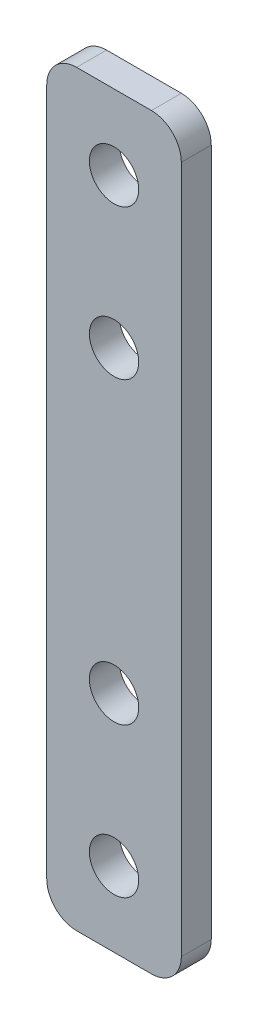
ISO-10303-21;
HEADER;
FILE_DESCRIPTION(('STEP AP214'),'2;1');
FILE_NAME('part.step','',(''),(''),'','','');
FILE_SCHEMA(('AUTOMOTIVE_DESIGN { 1 0 10303 214 1 1 1 1 }'));
ENDSEC;
DATA;
#1=APPLICATION_CONTEXT('core data for automotive mechanical design processes');
#2=APPLICATION_PROTOCOL_DEFINITION('international standard','automotive_design',2000,#1);
#3=PRODUCT_CONTEXT('',#1,'mechanical');
#4=PRODUCT('Part','Part','',(#3));
#5=PRODUCT_RELATED_PRODUCT_CATEGORY('part','',(#4));
#6=PRODUCT_DEFINITION_FORMATION('','',#4);
#7=PRODUCT_DEFINITION_CONTEXT('part definition',#1,'design');
#8=PRODUCT_DEFINITION('design','',#6,#7);
#9=PRODUCT_DEFINITION_SHAPE('','',#8);
#10=(LENGTH_UNIT() NAMED_UNIT(*) SI_UNIT(.MILLI.,.METRE.));
#11=(NAMED_UNIT(*) PLANE_ANGLE_UNIT() SI_UNIT($,.RADIAN.));
#12=(NAMED_UNIT(*) SI_UNIT($,.STERADIAN.) SOLID_ANGLE_UNIT());
#13=UNCERTAINTY_MEASURE_WITH_UNIT(LENGTH_MEASURE(1.E-05),#10,'distance_accuracy_value','');
#14=(GEOMETRIC_REPRESENTATION_CONTEXT(3) GLOBAL_UNCERTAINTY_ASSIGNED_CONTEXT((#13)) GLOBAL_UNIT_ASSIGNED_CONTEXT((#10,
#11,#12)) REPRESENTATION_CONTEXT('',''));
#15=CARTESIAN_POINT('',(0.,0.,0.));
#16=DIRECTION('',(0.,0.,1.));
#17=DIRECTION('',(1.,0.,0.));
#18=AXIS2_PLACEMENT_3D('',#15,#16,#17);
#19=CARTESIAN_POINT('',(4.5,-25.,2.));
#20=DIRECTION('',(-1.,0.,0.));
#21=DIRECTION('',(0.,0.,1.));
#22=AXIS2_PLACEMENT_3D('',#19,#20,#21);
#23=PLANE('',#22);
#24=DIRECTION('',(0.,1.,0.));
#25=VECTOR('',#24,1.);
#26=CARTESIAN_POINT('',(4.5,-25.,2.));
#27=LINE('',#26,#25);
#28=CARTESIAN_POINT('',(4.5,-23.,2.));
#29=VERTEX_POINT('',#28);
#30=CARTESIAN_POINT('',(4.5,23.,2.));
#31=VERTEX_POINT('',#30);
#32=EDGE_CURVE('E130',#29,#31,#27,.T.);
#33=ORIENTED_EDGE('',*,*,#32,.F.);
#34=DIRECTION('',(0.,0.,-1.));
#35=VECTOR('',#34,1.);
#36=CARTESIAN_POINT('',(4.5,-23.,2.));
#37=LINE('',#36,#35);
#38=CARTESIAN_POINT('',(4.5,-23.,0.));
#39=VERTEX_POINT('',#38);
#40=EDGE_CURVE('E169',#29,#39,#37,.T.);
#41=ORIENTED_EDGE('',*,*,#40,.T.);
#42=DIRECTION('',(0.,1.,0.));
#43=VECTOR('',#42,1.);
#44=CARTESIAN_POINT('',(4.5,-25.,0.));
#45=LINE('',#44,#43);
#46=CARTESIAN_POINT('',(4.5,23.,0.));
#47=VERTEX_POINT('',#46);
#48=EDGE_CURVE('E175',#39,#47,#45,.T.);
#49=ORIENTED_EDGE('',*,*,#48,.T.);
#50=DIRECTION('',(0.,0.,-1.));
#51=VECTOR('',#50,1.);
#52=CARTESIAN_POINT('',(4.5,23.,2.));
#53=LINE('',#52,#51);
#54=EDGE_CURVE('E167',#47,#31,#53,.F.);
#55=ORIENTED_EDGE('',*,*,#54,.T.);
#56=EDGE_LOOP('',(#33,#41,#49,#55));
#57=FACE_BOUND('',#56,.T.);
#58=ADVANCED_FACE('F38',(#57),#23,.F.);
#59=CARTESIAN_POINT('',(-4.5,25.,2.));
#60=DIRECTION('',(0.,-1.,0.));
#61=DIRECTION('',(0.,0.,-1.));
#62=AXIS2_PLACEMENT_3D('',#59,#60,#61);
#63=PLANE('',#62);
#64=DIRECTION('',(-1.,0.,0.));
#65=VECTOR('',#64,1.);
#66=CARTESIAN_POINT('',(-4.5,25.,2.));
#67=LINE('',#66,#65);
#68=CARTESIAN_POINT('',(2.5,25.,2.));
#69=VERTEX_POINT('',#68);
#70=CARTESIAN_POINT('',(-2.5,25.,2.));
#71=VERTEX_POINT('',#70);
#72=EDGE_CURVE('E133',#69,#71,#67,.T.);
#73=ORIENTED_EDGE('',*,*,#72,.F.);
#74=DIRECTION('',(0.,0.,-1.));
#75=VECTOR('',#74,1.);
#76=CARTESIAN_POINT('',(2.5,25.,2.));
#77=LINE('',#76,#75);
#78=CARTESIAN_POINT('',(2.5,25.,0.));
#79=VERTEX_POINT('',#78);
#80=EDGE_CURVE('E11',#69,#79,#77,.T.);
#81=ORIENTED_EDGE('',*,*,#80,.T.);
#82=DIRECTION('',(-1.,0.,0.));
#83=VECTOR('',#82,1.);
#84=CARTESIAN_POINT('',(-4.5,25.,0.));
#85=LINE('',#84,#83);
#86=CARTESIAN_POINT('',(-2.5,25.,0.));
#87=VERTEX_POINT('',#86);
#88=EDGE_CURVE('E135',#79,#87,#85,.T.);
#89=ORIENTED_EDGE('',*,*,#88,.T.);
#90=DIRECTION('',(0.,0.,-1.));
#91=VECTOR('',#90,1.);
#92=CARTESIAN_POINT('',(-2.5,25.,2.));
#93=LINE('',#92,#91);
#94=EDGE_CURVE('E46',#87,#71,#93,.F.);
#95=ORIENTED_EDGE('',*,*,#94,.T.);
#96=EDGE_LOOP('',(#73,#81,#89,#95));
#97=FACE_BOUND('',#96,.T.);
#98=ADVANCED_FACE('F216',(#97),#63,.F.);
#99=CARTESIAN_POINT('',(-4.5,-25.,2.));
#100=DIRECTION('',(1.,0.,0.));
#101=DIRECTION('',(0.,0.,-1.));
#102=AXIS2_PLACEMENT_3D('',#99,#100,#101);
#103=PLANE('',#102);
#104=DIRECTION('',(0.,-1.,0.));
#105=VECTOR('',#104,1.);
#106=CARTESIAN_POINT('',(-4.5,-25.,0.));
#107=LINE('',#106,#105);
#108=CARTESIAN_POINT('',(-4.5,23.,0.));
#109=VERTEX_POINT('',#108);
#110=CARTESIAN_POINT('',(-4.5,-23.,0.));
#111=VERTEX_POINT('',#110);
#112=EDGE_CURVE('E131',#109,#111,#107,.T.);
#113=ORIENTED_EDGE('',*,*,#112,.T.);
#114=DIRECTION('',(0.,0.,-1.));
#115=VECTOR('',#114,1.);
#116=CARTESIAN_POINT('',(-4.5,-23.,2.));
#117=LINE('',#116,#115);
#118=CARTESIAN_POINT('',(-4.5,-23.,2.));
#119=VERTEX_POINT('',#118);
#120=EDGE_CURVE('E109',#111,#119,#117,.F.);
#121=ORIENTED_EDGE('',*,*,#120,.T.);
#122=DIRECTION('',(0.,-1.,0.));
#123=VECTOR('',#122,1.);
#124=CARTESIAN_POINT('',(-4.5,-25.,2.));
#125=LINE('',#124,#123);
#126=CARTESIAN_POINT('',(-4.5,23.,2.));
#127=VERTEX_POINT('',#126);
#128=EDGE_CURVE('E186',#127,#119,#125,.T.);
#129=ORIENTED_EDGE('',*,*,#128,.F.);
#130=DIRECTION('',(0.,0.,-1.));
#131=VECTOR('',#130,1.);
#132=CARTESIAN_POINT('',(-4.5,23.,2.));
#133=LINE('',#132,#131);
#134=EDGE_CURVE('E114',#127,#109,#133,.T.);
#135=ORIENTED_EDGE('',*,*,#134,.T.);
#136=EDGE_LOOP('',(#113,#121,#129,#135));
#137=FACE_BOUND('',#136,.T.);
#138=ADVANCED_FACE('F214',(#137),#103,.F.);
#139=CARTESIAN_POINT('',(-4.5,-25.,2.));
#140=DIRECTION('',(0.,1.,0.));
#141=DIRECTION('',(0.,0.,1.));
#142=AXIS2_PLACEMENT_3D('',#139,#140,#141);
#143=PLANE('',#142);
#144=DIRECTION('',(1.,0.,0.));
#145=VECTOR('',#144,1.);
#146=CARTESIAN_POINT('',(-4.5,-25.,2.));
#147=LINE('',#146,#145);
#148=CARTESIAN_POINT('',(-2.5,-25.,2.));
#149=VERTEX_POINT('',#148);
#150=CARTESIAN_POINT('',(2.5,-25.,2.));
#151=VERTEX_POINT('',#150);
#152=EDGE_CURVE('E124',#149,#151,#147,.T.);
#153=ORIENTED_EDGE('',*,*,#152,.F.);
#154=DIRECTION('',(0.,0.,-1.));
#155=VECTOR('',#154,1.);
#156=CARTESIAN_POINT('',(-2.5,-25.,2.));
#157=LINE('',#156,#155);
#158=CARTESIAN_POINT('',(-2.5,-25.,0.));
#159=VERTEX_POINT('',#158);
#160=EDGE_CURVE('E108',#149,#159,#157,.T.);
#161=ORIENTED_EDGE('',*,*,#160,.T.);
#162=DIRECTION('',(1.,0.,0.));
#163=VECTOR('',#162,1.);
#164=CARTESIAN_POINT('',(-4.5,-25.,0.));
#165=LINE('',#164,#163);
#166=CARTESIAN_POINT('',(2.5,-25.,0.));
#167=VERTEX_POINT('',#166);
#168=EDGE_CURVE('E121',#159,#167,#165,.T.);
#169=ORIENTED_EDGE('',*,*,#168,.T.);
#170=DIRECTION('',(0.,0.,-1.));
#171=VECTOR('',#170,1.);
#172=CARTESIAN_POINT('',(2.5,-25.,2.));
#173=LINE('',#172,#171);
#174=EDGE_CURVE('E126',#167,#151,#173,.F.);
#175=ORIENTED_EDGE('',*,*,#174,.T.);
#176=EDGE_LOOP('',(#153,#161,#169,#175));
#177=FACE_BOUND('',#176,.T.);
#178=ADVANCED_FACE('F120',(#177),#143,.F.);
#179=CARTESIAN_POINT('',(0.,0.,2.));
#180=DIRECTION('',(0.,0.,-1.));
#181=DIRECTION('',(-1.,0.,0.));
#182=AXIS2_PLACEMENT_3D('',#179,#180,#181);
#183=PLANE('',#182);
#184=CARTESIAN_POINT('',(0.,20.,2.));
#185=DIRECTION('',(0.,0.,1.));
#186=DIRECTION('',(1.,0.,0.));
#187=AXIS2_PLACEMENT_3D('',#184,#185,#186);
#188=CIRCLE('',#187,1.65);
#189=CARTESIAN_POINT('',(1.65,20.,2.));
#190=VERTEX_POINT('',#189);
#191=EDGE_CURVE('E151',#190,#190,#188,.T.);
#192=ORIENTED_EDGE('',*,*,#191,.F.);
#193=EDGE_LOOP('',(#192));
#194=FACE_BOUND('',#193,.T.);
#195=CARTESIAN_POINT('',(0.,10.,2.));
#196=DIRECTION('',(0.,0.,1.));
#197=DIRECTION('',(1.,0.,0.));
#198=AXIS2_PLACEMENT_3D('',#195,#196,#197);
#199=CIRCLE('',#198,1.65);
#200=CARTESIAN_POINT('',(1.65,10.,2.));
#201=VERTEX_POINT('',#200);
#202=EDGE_CURVE('E147',#201,#201,#199,.T.);
#203=ORIENTED_EDGE('',*,*,#202,.F.);
#204=EDGE_LOOP('',(#203));
#205=FACE_BOUND('',#204,.T.);
#206=CARTESIAN_POINT('',(0.,-20.,2.));
#207=DIRECTION('',(0.,0.,1.));
#208=DIRECTION('',(1.,0.,0.));
#209=AXIS2_PLACEMENT_3D('',#206,#207,#208);
#210=CIRCLE('',#209,1.65);
#211=CARTESIAN_POINT('',(1.65,-20.,2.));
#212=VERTEX_POINT('',#211);
#213=EDGE_CURVE('E143',#212,#212,#210,.T.);
#214=ORIENTED_EDGE('',*,*,#213,.F.);
#215=EDGE_LOOP('',(#214));
#216=FACE_BOUND('',#215,.T.);
#217=CARTESIAN_POINT('',(0.,-10.,2.));
#218=DIRECTION('',(0.,0.,1.));
#219=DIRECTION('',(1.,0.,0.));
#220=AXIS2_PLACEMENT_3D('',#217,#218,#219);
#221=CIRCLE('',#220,1.65);
#222=CARTESIAN_POINT('',(1.65,-10.,2.));
#223=VERTEX_POINT('',#222);
#224=EDGE_CURVE('E142',#223,#223,#221,.T.);
#225=ORIENTED_EDGE('',*,*,#224,.F.);
#226=EDGE_LOOP('',(#225));
#227=FACE_BOUND('',#226,.T.);
#228=ORIENTED_EDGE('',*,*,#128,.T.);
#229=CARTESIAN_POINT('',(-2.5,-23.,2.));
#230=DIRECTION('',(0.,0.,-1.));
#231=DIRECTION('',(-1.,0.,0.));
#232=AXIS2_PLACEMENT_3D('',#229,#230,#231);
#233=CIRCLE('',#232,2.);
#234=EDGE_CURVE('E165',#119,#149,#233,.F.);
#235=ORIENTED_EDGE('',*,*,#234,.T.);
#236=ORIENTED_EDGE('',*,*,#152,.T.);
#237=CARTESIAN_POINT('',(2.5,-23.,2.));
#238=DIRECTION('',(0.,0.,-1.));
#239=DIRECTION('',(-1.,0.,0.));
#240=AXIS2_PLACEMENT_3D('',#237,#238,#239);
#241=CIRCLE('',#240,2.);
#242=EDGE_CURVE('E163',#151,#29,#241,.F.);
#243=ORIENTED_EDGE('',*,*,#242,.T.);
#244=ORIENTED_EDGE('',*,*,#32,.T.);
#245=CARTESIAN_POINT('',(2.5,23.,2.));
#246=DIRECTION('',(0.,0.,-1.));
#247=DIRECTION('',(-1.,0.,0.));
#248=AXIS2_PLACEMENT_3D('',#245,#246,#247);
#249=CIRCLE('',#248,2.);
#250=EDGE_CURVE('E59',#31,#69,#249,.F.);
#251=ORIENTED_EDGE('',*,*,#250,.T.);
#252=ORIENTED_EDGE('',*,*,#72,.T.);
#253=CARTESIAN_POINT('',(-2.5,23.,2.));
#254=DIRECTION('',(0.,0.,-1.));
#255=DIRECTION('',(-1.,0.,0.));
#256=AXIS2_PLACEMENT_3D('',#253,#254,#255);
#257=CIRCLE('',#256,2.);
#258=EDGE_CURVE('E160',#71,#127,#257,.F.);
#259=ORIENTED_EDGE('',*,*,#258,.T.);
#260=EDGE_LOOP('',(#228,#235,#236,#243,#244,#251,#252,#259));
#261=FACE_BOUND('',#260,.T.);
#262=ADVANCED_FACE('F201',(#194,#205,#216,#227,#261),#183,.F.);
#263=CARTESIAN_POINT('',(0.,0.,0.));
#264=DIRECTION('',(0.,0.,-1.));
#265=DIRECTION('',(-1.,0.,0.));
#266=AXIS2_PLACEMENT_3D('',#263,#264,#265);
#267=PLANE('',#266);
#268=CARTESIAN_POINT('',(0.,20.,0.));
#269=DIRECTION('',(0.,0.,-1.));
#270=DIRECTION('',(-1.,0.,0.));
#271=AXIS2_PLACEMENT_3D('',#268,#269,#270);
#272=CIRCLE('',#271,1.65);
#273=CARTESIAN_POINT('',(-1.65,20.,0.));
#274=VERTEX_POINT('',#273);
#275=EDGE_CURVE('E148',#274,#274,#272,.T.);
#276=ORIENTED_EDGE('',*,*,#275,.F.);
#277=EDGE_LOOP('',(#276));
#278=FACE_BOUND('',#277,.T.);
#279=CARTESIAN_POINT('',(0.,10.,0.));
#280=DIRECTION('',(0.,0.,-1.));
#281=DIRECTION('',(-1.,0.,0.));
#282=AXIS2_PLACEMENT_3D('',#279,#280,#281);
#283=CIRCLE('',#282,1.65);
#284=CARTESIAN_POINT('',(-1.65,10.,0.));
#285=VERTEX_POINT('',#284);
#286=EDGE_CURVE('E144',#285,#285,#283,.T.);
#287=ORIENTED_EDGE('',*,*,#286,.F.);
#288=EDGE_LOOP('',(#287));
#289=FACE_BOUND('',#288,.T.);
#290=CARTESIAN_POINT('',(0.,-20.,0.));
#291=DIRECTION('',(0.,0.,-1.));
#292=DIRECTION('',(-1.,0.,0.));
#293=AXIS2_PLACEMENT_3D('',#290,#291,#292);
#294=CIRCLE('',#293,1.65);
#295=CARTESIAN_POINT('',(-1.65,-20.,0.));
#296=VERTEX_POINT('',#295);
#297=EDGE_CURVE('E139',#296,#296,#294,.T.);
#298=ORIENTED_EDGE('',*,*,#297,.F.);
#299=EDGE_LOOP('',(#298));
#300=FACE_BOUND('',#299,.T.);
#301=CARTESIAN_POINT('',(0.,-10.,0.));
#302=DIRECTION('',(0.,0.,-1.));
#303=DIRECTION('',(-1.,0.,0.));
#304=AXIS2_PLACEMENT_3D('',#301,#302,#303);
#305=CIRCLE('',#304,1.65);
#306=CARTESIAN_POINT('',(-1.65,-10.,0.));
#307=VERTEX_POINT('',#306);
#308=EDGE_CURVE('E180',#307,#307,#305,.T.);
#309=ORIENTED_EDGE('',*,*,#308,.F.);
#310=EDGE_LOOP('',(#309));
#311=FACE_BOUND('',#310,.T.);
#312=ORIENTED_EDGE('',*,*,#168,.F.);
#313=CARTESIAN_POINT('',(-2.5,-23.,0.));
#314=DIRECTION('',(0.,0.,-1.));
#315=DIRECTION('',(-1.,0.,0.));
#316=AXIS2_PLACEMENT_3D('',#313,#314,#315);
#317=CIRCLE('',#316,2.);
#318=EDGE_CURVE('E104',#159,#111,#317,.T.);
#319=ORIENTED_EDGE('',*,*,#318,.T.);
#320=ORIENTED_EDGE('',*,*,#112,.F.);
#321=CARTESIAN_POINT('',(-2.5,23.,0.));
#322=DIRECTION('',(0.,0.,-1.));
#323=DIRECTION('',(-1.,0.,0.));
#324=AXIS2_PLACEMENT_3D('',#321,#322,#323);
#325=CIRCLE('',#324,2.);
#326=EDGE_CURVE('E125',#109,#87,#325,.T.);
#327=ORIENTED_EDGE('',*,*,#326,.T.);
#328=ORIENTED_EDGE('',*,*,#88,.F.);
#329=CARTESIAN_POINT('',(2.5,23.,0.));
#330=DIRECTION('',(0.,0.,-1.));
#331=DIRECTION('',(-1.,0.,0.));
#332=AXIS2_PLACEMENT_3D('',#329,#330,#331);
#333=CIRCLE('',#332,2.);
#334=EDGE_CURVE('E154',#79,#47,#333,.T.);
#335=ORIENTED_EDGE('',*,*,#334,.T.);
#336=ORIENTED_EDGE('',*,*,#48,.F.);
#337=CARTESIAN_POINT('',(2.5,-23.,0.));
#338=DIRECTION('',(0.,0.,-1.));
#339=DIRECTION('',(-1.,0.,0.));
#340=AXIS2_PLACEMENT_3D('',#337,#338,#339);
#341=CIRCLE('',#340,2.);
#342=EDGE_CURVE('E115',#39,#167,#341,.T.);
#343=ORIENTED_EDGE('',*,*,#342,.T.);
#344=EDGE_LOOP('',(#312,#319,#320,#327,#328,#335,#336,#343));
#345=FACE_BOUND('',#344,.T.);
#346=ADVANCED_FACE('F128',(#278,#289,#300,#311,#345),#267,.T.);
#347=CARTESIAN_POINT('',(0.,-10.,2.));
#348=DIRECTION('',(0.,0.,1.));
#349=DIRECTION('',(1.,0.,0.));
#350=AXIS2_PLACEMENT_3D('',#347,#348,#349);
#351=CYLINDRICAL_SURFACE('',#350,1.65);
#352=ORIENTED_EDGE('',*,*,#308,.T.);
#353=EDGE_LOOP('',(#352));
#354=FACE_BOUND('',#353,.T.);
#355=ORIENTED_EDGE('',*,*,#224,.T.);
#356=EDGE_LOOP('',(#355));
#357=FACE_BOUND('',#356,.T.);
#358=ADVANCED_FACE('F240',(#354,#357),#351,.F.);
#359=CARTESIAN_POINT('',(0.,-20.,2.));
#360=DIRECTION('',(0.,0.,1.));
#361=DIRECTION('',(1.,0.,0.));
#362=AXIS2_PLACEMENT_3D('',#359,#360,#361);
#363=CYLINDRICAL_SURFACE('',#362,1.65);
#364=ORIENTED_EDGE('',*,*,#297,.T.);
#365=EDGE_LOOP('',(#364));
#366=FACE_BOUND('',#365,.T.);
#367=ORIENTED_EDGE('',*,*,#213,.T.);
#368=EDGE_LOOP('',(#367));
#369=FACE_BOUND('',#368,.T.);
#370=ADVANCED_FACE('F245',(#366,#369),#363,.F.);
#371=CARTESIAN_POINT('',(0.,10.,2.));
#372=DIRECTION('',(0.,0.,1.));
#373=DIRECTION('',(1.,0.,0.));
#374=AXIS2_PLACEMENT_3D('',#371,#372,#373);
#375=CYLINDRICAL_SURFACE('',#374,1.65);
#376=ORIENTED_EDGE('',*,*,#286,.T.);
#377=EDGE_LOOP('',(#376));
#378=FACE_BOUND('',#377,.T.);
#379=ORIENTED_EDGE('',*,*,#202,.T.);
#380=EDGE_LOOP('',(#379));
#381=FACE_BOUND('',#380,.T.);
#382=ADVANCED_FACE('F249',(#378,#381),#375,.F.);
#383=CARTESIAN_POINT('',(0.,20.,2.));
#384=DIRECTION('',(0.,0.,1.));
#385=DIRECTION('',(1.,0.,0.));
#386=AXIS2_PLACEMENT_3D('',#383,#384,#385);
#387=CYLINDRICAL_SURFACE('',#386,1.65);
#388=ORIENTED_EDGE('',*,*,#275,.T.);
#389=EDGE_LOOP('',(#388));
#390=FACE_BOUND('',#389,.T.);
#391=ORIENTED_EDGE('',*,*,#191,.T.);
#392=EDGE_LOOP('',(#391));
#393=FACE_BOUND('',#392,.T.);
#394=ADVANCED_FACE('F199',(#390,#393),#387,.F.);
#395=CARTESIAN_POINT('',(-2.5,-23.,2.));
#396=DIRECTION('',(0.,0.,-1.));
#397=DIRECTION('',(-1.,0.,0.));
#398=AXIS2_PLACEMENT_3D('',#395,#396,#397);
#399=CYLINDRICAL_SURFACE('',#398,2.);
#400=ORIENTED_EDGE('',*,*,#234,.F.);
#401=ORIENTED_EDGE('',*,*,#120,.F.);
#402=ORIENTED_EDGE('',*,*,#318,.F.);
#403=ORIENTED_EDGE('',*,*,#160,.F.);
#404=EDGE_LOOP('',(#400,#401,#402,#403));
#405=FACE_BOUND('',#404,.T.);
#406=ADVANCED_FACE('F107',(#405),#399,.T.);
#407=CARTESIAN_POINT('',(2.5,-23.,2.));
#408=DIRECTION('',(0.,0.,-1.));
#409=DIRECTION('',(-1.,0.,0.));
#410=AXIS2_PLACEMENT_3D('',#407,#408,#409);
#411=CYLINDRICAL_SURFACE('',#410,2.);
#412=ORIENTED_EDGE('',*,*,#242,.F.);
#413=ORIENTED_EDGE('',*,*,#174,.F.);
#414=ORIENTED_EDGE('',*,*,#342,.F.);
#415=ORIENTED_EDGE('',*,*,#40,.F.);
#416=EDGE_LOOP('',(#412,#413,#414,#415));
#417=FACE_BOUND('',#416,.T.);
#418=ADVANCED_FACE('F220',(#417),#411,.T.);
#419=CARTESIAN_POINT('',(2.5,23.,2.));
#420=DIRECTION('',(0.,0.,-1.));
#421=DIRECTION('',(-1.,0.,0.));
#422=AXIS2_PLACEMENT_3D('',#419,#420,#421);
#423=CYLINDRICAL_SURFACE('',#422,2.);
#424=ORIENTED_EDGE('',*,*,#250,.F.);
#425=ORIENTED_EDGE('',*,*,#54,.F.);
#426=ORIENTED_EDGE('',*,*,#334,.F.);
#427=ORIENTED_EDGE('',*,*,#80,.F.);
#428=EDGE_LOOP('',(#424,#425,#426,#427));
#429=FACE_BOUND('',#428,.T.);
#430=ADVANCED_FACE('F219',(#429),#423,.T.);
#431=CARTESIAN_POINT('',(-2.5,23.,2.));
#432=DIRECTION('',(0.,0.,-1.));
#433=DIRECTION('',(-1.,0.,0.));
#434=AXIS2_PLACEMENT_3D('',#431,#432,#433);
#435=CYLINDRICAL_SURFACE('',#434,2.);
#436=ORIENTED_EDGE('',*,*,#258,.F.);
#437=ORIENTED_EDGE('',*,*,#94,.F.);
#438=ORIENTED_EDGE('',*,*,#326,.F.);
#439=ORIENTED_EDGE('',*,*,#134,.F.);
#440=EDGE_LOOP('',(#436,#437,#438,#439));
#441=FACE_BOUND('',#440,.T.);
#442=ADVANCED_FACE('F40',(#441),#435,.T.);
#443=CLOSED_SHELL('',(#58,#98,#138,#178,#262,#346,#358,#370,#382,#394,#406,#418,#430,#442));
#444=MANIFOLD_SOLID_BREP('B2',#443);
#445=ADVANCED_BREP_SHAPE_REPRESENTATION('',(#18,#444),#14);
#446=SHAPE_DEFINITION_REPRESENTATION(#9,#445);
ENDSEC;
END-ISO-10303-21;
